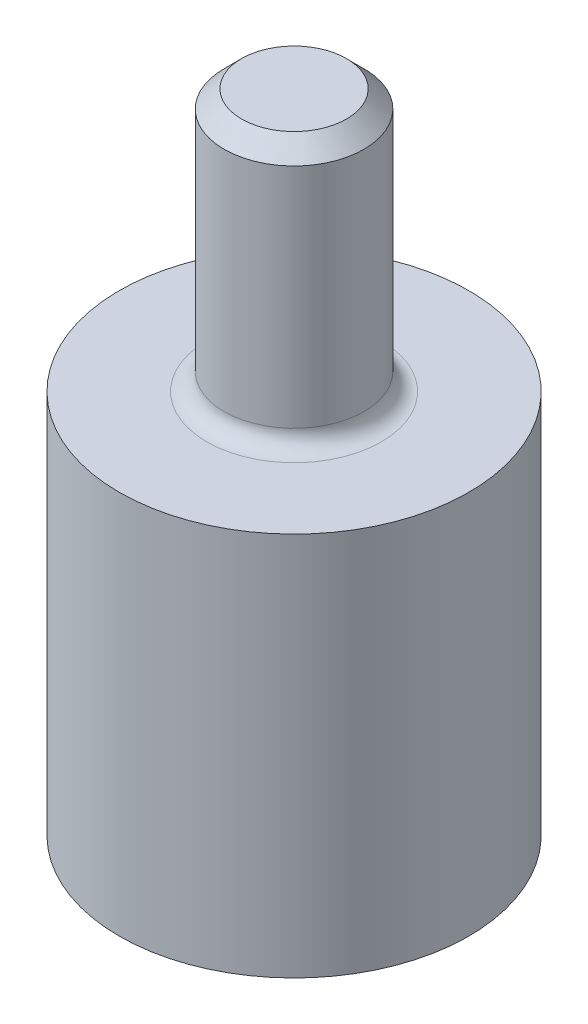
ISO-10303-21;
HEADER;
FILE_DESCRIPTION(('STEP AP214'),'2;1');
FILE_NAME('part.step','',(''),(''),'','','');
FILE_SCHEMA(('AUTOMOTIVE_DESIGN { 1 0 10303 214 1 1 1 1 }'));
ENDSEC;
DATA;
#1=APPLICATION_CONTEXT('core data for automotive mechanical design processes');
#2=APPLICATION_PROTOCOL_DEFINITION('international standard','automotive_design',2000,#1);
#3=PRODUCT_CONTEXT('',#1,'mechanical');
#4=PRODUCT('Part','Part','',(#3));
#5=PRODUCT_RELATED_PRODUCT_CATEGORY('part','',(#4));
#6=PRODUCT_DEFINITION_FORMATION('','',#4);
#7=PRODUCT_DEFINITION_CONTEXT('part definition',#1,'design');
#8=PRODUCT_DEFINITION('design','',#6,#7);
#9=PRODUCT_DEFINITION_SHAPE('','',#8);
#10=(LENGTH_UNIT() NAMED_UNIT(*) SI_UNIT(.MILLI.,.METRE.));
#11=(NAMED_UNIT(*) PLANE_ANGLE_UNIT() SI_UNIT($,.RADIAN.));
#12=(NAMED_UNIT(*) SI_UNIT($,.STERADIAN.) SOLID_ANGLE_UNIT());
#13=UNCERTAINTY_MEASURE_WITH_UNIT(LENGTH_MEASURE(1.E-05),#10,'distance_accuracy_value','');
#14=(GEOMETRIC_REPRESENTATION_CONTEXT(3) GLOBAL_UNCERTAINTY_ASSIGNED_CONTEXT((#13)) GLOBAL_UNIT_ASSIGNED_CONTEXT((#10,
#11,#12)) REPRESENTATION_CONTEXT('',''));
#15=CARTESIAN_POINT('',(0.,0.,0.));
#16=DIRECTION('',(0.,0.,1.));
#17=DIRECTION('',(1.,0.,0.));
#18=AXIS2_PLACEMENT_3D('',#15,#16,#17);
#19=CARTESIAN_POINT('',(0.,22.,0.));
#20=DIRECTION('',(0.,-1.,0.));
#21=DIRECTION('',(0.,0.,-1.));
#22=AXIS2_PLACEMENT_3D('',#19,#20,#21);
#23=CYLINDRICAL_SURFACE('',#22,10.);
#24=CARTESIAN_POINT('',(-10.,2.65,0.));
#25=CARTESIAN_POINT('',(-9.99999888063832,2.65000317277199,-0.0754619928033734));
#26=CARTESIAN_POINT('',(-9.99913682811447,2.65634858042257,-0.150969869142969));
#27=CARTESIAN_POINT('',(-9.99578086597856,2.68155946395463,-0.29988092356667));
#28=CARTESIAN_POINT('',(-9.99328529597587,2.70043767909989,-0.373281880743254));
#29=CARTESIAN_POINT('',(-9.98694317619014,2.7501447786592,-0.515802030248598));
#30=CARTESIAN_POINT('',(-9.98309757849417,2.78096524256388,-0.584924199822183));
#31=CARTESIAN_POINT('',(-9.9744820594727,2.85366269211814,-0.717003214570632));
#32=CARTESIAN_POINT('',(-9.96971228523732,2.89553791869733,-0.779961038453511));
#33=CARTESIAN_POINT('',(-9.95974611568941,2.98944147754408,-0.898338108312009));
#34=CARTESIAN_POINT('',(-9.95454744334816,3.04152632870852,-0.953712333159151));
#35=CARTESIAN_POINT('',(-9.9443275535923,3.15424914589613,-1.05496231993912));
#36=CARTESIAN_POINT('',(-9.93930634565644,3.2148875679238,-1.10083757514474));
#37=CARTESIAN_POINT('',(-9.92998765268688,3.34329274754207,-1.18195809747663));
#38=CARTESIAN_POINT('',(-9.92569310616535,3.41108672869265,-1.21716063931035));
#39=CARTESIAN_POINT('',(-9.91834447659887,3.55169218639022,-1.27566354643984));
#40=CARTESIAN_POINT('',(-9.9152903388053,3.62450344132103,-1.29896443705713));
#41=CARTESIAN_POINT('',(-9.9107903599778,3.77260675419918,-1.33286460358717));
#42=CARTESIAN_POINT('',(-9.90933484179661,3.84788101242966,-1.34354033567971));
#43=CARTESIAN_POINT('',(-9.90816739077428,3.99916564561434,-1.3521238264948));
#44=CARTESIAN_POINT('',(-9.90845537651516,4.07517598602955,-1.35003218142711));
#45=CARTESIAN_POINT('',(-9.91073353943524,4.22523956258491,-1.33320294565254));
#46=CARTESIAN_POINT('',(-9.91271233284641,4.29930248057158,-1.31854992526651));
#47=CARTESIAN_POINT('',(-9.9181313878244,4.44390856940861,-1.27714599976141));
#48=CARTESIAN_POINT('',(-9.92157168347992,4.51445165811811,-1.25039481245862));
#49=CARTESIAN_POINT('',(-9.92953889350849,4.65027630297044,-1.18546414002735));
#50=CARTESIAN_POINT('',(-9.9340692593953,4.71554024852512,-1.14724825716348));
#51=CARTESIAN_POINT('',(-9.94370355539347,4.83876090400285,-1.06049899452053));
#52=CARTESIAN_POINT('',(-9.94880751606598,4.89671722422605,-1.01196506487275));
#53=CARTESIAN_POINT('',(-9.95906440897064,5.00416806207097,-0.905490408568418));
#54=CARTESIAN_POINT('',(-9.96421740371901,5.05359043725637,-0.847476855238479));
#55=CARTESIAN_POINT('',(-9.97395328850661,5.14200755646752,-0.723939528141936));
#56=CARTESIAN_POINT('',(-9.97853617683064,5.18100226912122,-0.65841573178129));
#57=CARTESIAN_POINT('',(-9.98661902116,5.24745857768345,-0.521659654039003));
#58=CARTESIAN_POINT('',(-9.99011851559678,5.2749152597109,-0.450424955814264));
#59=CARTESIAN_POINT('',(-9.99563623203195,5.31745678749493,-0.304298284152512));
#60=CARTESIAN_POINT('',(-9.99765453499948,5.33254230952476,-0.229406510867798));
#61=CARTESIAN_POINT('',(-9.99997186248422,5.349818874499,-0.078714934673022));
#62=CARTESIAN_POINT('',(-10.0002841271737,5.35210922101182,-0.00292671255106484));
#63=CARTESIAN_POINT('',(-9.99919005352924,5.34399305905822,0.147952556499445));
#64=CARTESIAN_POINT('',(-9.99778375804286,5.33358686714471,0.22304362076266));
#65=CARTESIAN_POINT('',(-9.99341879328227,5.30045555402826,0.370101053494709));
#66=CARTESIAN_POINT('',(-9.99046614145111,5.27777817326132,0.442078371506373));
#67=CARTESIAN_POINT('',(-9.98333879043991,5.22079811250311,0.581208755482311));
#68=CARTESIAN_POINT('',(-9.97916404358472,5.18649497897124,0.648361633112986));
#69=CARTESIAN_POINT('',(-9.97002435262575,5.10699965932624,0.776377832753262));
#70=CARTESIAN_POINT('',(-9.9650548411669,5.0617437070004,0.837201225473106));
#71=CARTESIAN_POINT('',(-9.9548947947186,4.96171706429935,0.950424716120299));
#72=CARTESIAN_POINT('',(-9.94970424944,4.90694593062478,1.00282442138043));
#73=CARTESIAN_POINT('',(-9.93964585603091,4.78900444544845,1.09806885763805));
#74=CARTESIAN_POINT('',(-9.93478039313452,4.7257804702606,1.14084747545805));
#75=CARTESIAN_POINT('',(-9.92596344446456,4.59298629332693,1.21517761423776));
#76=CARTESIAN_POINT('',(-9.9220119378588,4.52341623628052,1.24672939110457));
#77=CARTESIAN_POINT('',(-9.91548697301,4.38011191166092,1.29760489107688));
#78=CARTESIAN_POINT('',(-9.91290942391312,4.30639073671037,1.31696494568639));
#79=CARTESIAN_POINT('',(-9.90941281755323,4.15670648021006,1.34302395800419));
#80=CARTESIAN_POINT('',(-9.90849366916185,4.08074352207844,1.34972361139683));
#81=CARTESIAN_POINT('',(-9.90842088198776,3.92939016878468,1.35025744062788));
#82=CARTESIAN_POINT('',(-9.90925298633456,3.85400012601917,1.34419550785697));
#83=CARTESIAN_POINT('',(-9.9125581709462,3.70532136888273,1.31959923933092));
#84=CARTESIAN_POINT('',(-9.91503125042156,3.63203265350087,1.30106490957631));
#85=CARTESIAN_POINT('',(-9.9213351038829,3.48965638877924,1.25208409948606));
#86=CARTESIAN_POINT('',(-9.92516520887735,3.42056678897022,1.22164348798663));
#87=CARTESIAN_POINT('',(-9.93375254177548,3.28845907523205,1.14972442541764));
#88=CARTESIAN_POINT('',(-9.93850978887523,3.22544108705338,1.10824574580314));
#89=CARTESIAN_POINT('',(-9.94846169128068,3.10673549302644,1.01504542221476));
#90=CARTESIAN_POINT('',(-9.95365946544203,3.05110881813496,0.963246499079042));
#91=CARTESIAN_POINT('',(-9.96387978259459,2.94929879836129,0.851038566680569));
#92=CARTESIAN_POINT('',(-9.9689022842334,2.90311766965874,0.790627542416163));
#93=CARTESIAN_POINT('',(-9.97823111031075,2.82133168551852,0.662599690813559));
#94=CARTESIAN_POINT('',(-9.98253416400673,2.7857745822162,0.594952131612163));
#95=CARTESIAN_POINT('',(-9.98990664479829,2.72657756562985,0.454623107862652));
#96=CARTESIAN_POINT('',(-9.99297738800135,2.70292493147276,0.381947111499173));
#97=CARTESIAN_POINT('',(-9.99681378831678,2.67375878792272,0.257427740790176));
#98=CARTESIAN_POINT('',(-9.99800267851091,2.66486234984302,0.206363707072772));
#99=CARTESIAN_POINT('',(-9.99959616481477,2.65298189433552,0.103540312770609));
#100=CARTESIAN_POINT('',(-10.0000007680903,2.64999782288846,0.0517809585431028));
#101=CARTESIAN_POINT('',(-10.,2.65,0.));
#102=B_SPLINE_CURVE_WITH_KNOTS('',3,(#24,#25,#26,#27,#28,#29,#30,#31,#32,#33,#34,#35,#36,#37,
#38,#39,#40,#41,#42,#43,#44,#45,#46,#47,#48,#49,#50,#51,#52,#53,#54,#55,#56,#57,#58,#59,#60,#61,
#62,#63,#64,#65,#66,#67,#68,#69,#70,#71,#72,#73,#74,#75,#76,#77,#78,#79,#80,#81,#82,#83,#84,#85,
#86,#87,#88,#89,#90,#91,#92,#93,#94,#95,#96,#97,#98,#99,#100,#101),.UNSPECIFIED.,.T.,.F.,(4,2,2,
2,2,2,2,2,2,2,2,2,2,2,2,2,2,2,2,2,2,2,2,2,2,2,2,2,2,2,2,2,2,2,2,2,2,2,4),(0.,0.226196811709442,
0.452623899192089,0.67889162204794,0.905123362114559,1.13264478023607,1.3601783324746,
1.58861107839265,1.81703374075091,2.04406590633333,2.27108747007041,2.49659249268716,
2.7221027753678,2.94833671659616,3.17458271729316,3.40265648023177,3.63073092933234,
3.85890241385548,4.08706142448284,4.31344720305693,4.53982733744595,4.76533301790314,
4.9908474967373,5.21770789165439,5.44457885852408,5.67296416747486,5.90134427022682,
6.12904053575398,6.35672428909188,6.58256165180532,6.80839890586773,7.03412498039198,
7.25985572897408,7.48734500396144,7.71488759298809,7.94343804954776,8.17174376045445,
8.326958250701,8.4821713227998),.UNSPECIFIED.);
#103=CARTESIAN_POINT('',(-10.,2.65,0.));
#104=VERTEX_POINT('',#103);
#105=EDGE_CURVE('E65',#104,#104,#102,.T.);
#106=ORIENTED_EDGE('',*,*,#105,.T.);
#107=EDGE_LOOP('',(#106));
#108=FACE_BOUND('',#107,.T.);
#109=CARTESIAN_POINT('',(0.,5.35,-10.));
#110=CARTESIAN_POINT('',(-0.0754619928033734,5.34999682722801,-9.99999888063832));
#111=CARTESIAN_POINT('',(-0.150969869142969,5.34365141957743,-9.99913682811447));
#112=CARTESIAN_POINT('',(-0.29988092356667,5.31844053604537,-9.99578086597856));
#113=CARTESIAN_POINT('',(-0.373281880743254,5.29956232090011,-9.99328529597587));
#114=CARTESIAN_POINT('',(-0.515802030248598,5.2498552213408,-9.98694317619014));
#115=CARTESIAN_POINT('',(-0.584924199822183,5.21903475743613,-9.98309757849417));
#116=CARTESIAN_POINT('',(-0.717003214570632,5.14633730788186,-9.9744820594727));
#117=CARTESIAN_POINT('',(-0.779961038453512,5.10446208130267,-9.96971228523732));
#118=CARTESIAN_POINT('',(-0.898338108312009,5.01055852245592,-9.95974611568941));
#119=CARTESIAN_POINT('',(-0.953712333159151,4.95847367129148,-9.95454744334816));
#120=CARTESIAN_POINT('',(-1.05496231993912,4.84575085410387,-9.9443275535923));
#121=CARTESIAN_POINT('',(-1.10083757514474,4.7851124320762,-9.93930634565644));
#122=CARTESIAN_POINT('',(-1.18195809747663,4.65670725245793,-9.92998765268688));
#123=CARTESIAN_POINT('',(-1.21716063931035,4.58891327130735,-9.92569310616535));
#124=CARTESIAN_POINT('',(-1.27566354643984,4.44830781360978,-9.91834447659887));
#125=CARTESIAN_POINT('',(-1.29896443705713,4.37549655867898,-9.9152903388053));
#126=CARTESIAN_POINT('',(-1.33286460358717,4.22739324580082,-9.9107903599778));
#127=CARTESIAN_POINT('',(-1.34354033567971,4.15211898757034,-9.90933484179661));
#128=CARTESIAN_POINT('',(-1.3521238264948,4.00083435438566,-9.90816739077428));
#129=CARTESIAN_POINT('',(-1.35003218142711,3.92482401397045,-9.90845537651516));
#130=CARTESIAN_POINT('',(-1.33320294565254,3.77476043741509,-9.91073353943524));
#131=CARTESIAN_POINT('',(-1.31854992526651,3.70069751942843,-9.91271233284641));
#132=CARTESIAN_POINT('',(-1.27714599976141,3.55609143059139,-9.9181313878244));
#133=CARTESIAN_POINT('',(-1.25039481245862,3.48554834188189,-9.92157168347992));
#134=CARTESIAN_POINT('',(-1.18546414002735,3.34972369702956,-9.92953889350849));
#135=CARTESIAN_POINT('',(-1.14724825716348,3.28445975147488,-9.9340692593953));
#136=CARTESIAN_POINT('',(-1.06049899452053,3.16123909599715,-9.94370355539348));
#137=CARTESIAN_POINT('',(-1.01196506487275,3.10328277577395,-9.94880751606598));
#138=CARTESIAN_POINT('',(-0.905490408568418,2.99583193792903,-9.95906440897064));
#139=CARTESIAN_POINT('',(-0.84747685523848,2.94640956274364,-9.96421740371901));
#140=CARTESIAN_POINT('',(-0.723939528141936,2.85799244353248,-9.97395328850662));
#141=CARTESIAN_POINT('',(-0.65841573178129,2.81899773087878,-9.97853617683064));
#142=CARTESIAN_POINT('',(-0.521659654039003,2.75254142231655,-9.98661902116));
#143=CARTESIAN_POINT('',(-0.450424955814264,2.7250847402891,-9.99011851559678));
#144=CARTESIAN_POINT('',(-0.304298284152512,2.68254321250507,-9.99563623203195));
#145=CARTESIAN_POINT('',(-0.229406510867799,2.66745769047524,-9.99765453499948));
#146=CARTESIAN_POINT('',(-0.0787149346730221,2.650181125501,-9.99997186248422));
#147=CARTESIAN_POINT('',(-0.00292671255106494,2.64789077898818,-10.0002841271737));
#148=CARTESIAN_POINT('',(0.147952556499445,2.65600694094178,-9.99919005352924));
#149=CARTESIAN_POINT('',(0.22304362076266,2.66641313285529,-9.99778375804286));
#150=CARTESIAN_POINT('',(0.370101053494709,2.69954444597174,-9.99341879328227));
#151=CARTESIAN_POINT('',(0.442078371506373,2.72222182673868,-9.99046614145111));
#152=CARTESIAN_POINT('',(0.581208755482312,2.77920188749689,-9.98333879043991));
#153=CARTESIAN_POINT('',(0.648361633112987,2.81350502102876,-9.97916404358472));
#154=CARTESIAN_POINT('',(0.776377832753262,2.89300034067376,-9.97002435262575));
#155=CARTESIAN_POINT('',(0.837201225473106,2.9382562929996,-9.9650548411669));
#156=CARTESIAN_POINT('',(0.950424716120298,3.03828293570065,-9.9548947947186));
#157=CARTESIAN_POINT('',(1.00282442138043,3.09305406937521,-9.94970424944));
#158=CARTESIAN_POINT('',(1.09806885763805,3.21099555455155,-9.93964585603091));
#159=CARTESIAN_POINT('',(1.14084747545805,3.2742195297394,-9.93478039313452));
#160=CARTESIAN_POINT('',(1.21517761423776,3.40701370667307,-9.92596344446456));
#161=CARTESIAN_POINT('',(1.24672939110457,3.47658376371948,-9.9220119378588));
#162=CARTESIAN_POINT('',(1.29760489107688,3.61988808833909,-9.91548697301));
#163=CARTESIAN_POINT('',(1.31696494568639,3.69360926328963,-9.91290942391312));
#164=CARTESIAN_POINT('',(1.34302395800419,3.84329351978994,-9.90941281755323));
#165=CARTESIAN_POINT('',(1.34972361139683,3.91925647792156,-9.90849366916185));
#166=CARTESIAN_POINT('',(1.35025744062788,4.07060983121533,-9.90842088198776));
#167=CARTESIAN_POINT('',(1.34419550785697,4.14599987398084,-9.90925298633456));
#168=CARTESIAN_POINT('',(1.31959923933092,4.29467863111727,-9.9125581709462));
#169=CARTESIAN_POINT('',(1.30106490957631,4.36796734649913,-9.91503125042156));
#170=CARTESIAN_POINT('',(1.25208409948606,4.51034361122076,-9.9213351038829));
#171=CARTESIAN_POINT('',(1.22164348798663,4.57943321102978,-9.92516520887735));
#172=CARTESIAN_POINT('',(1.14972442541764,4.71154092476795,-9.93375254177548));
#173=CARTESIAN_POINT('',(1.10824574580314,4.77455891294662,-9.93850978887523));
#174=CARTESIAN_POINT('',(1.01504542221476,4.89326450697356,-9.94846169128068));
#175=CARTESIAN_POINT('',(0.963246499079042,4.94889118186504,-9.95365946544203));
#176=CARTESIAN_POINT('',(0.851038566680568,5.05070120163871,-9.96387978259459));
#177=CARTESIAN_POINT('',(0.790627542416163,5.09688233034126,-9.9689022842334));
#178=CARTESIAN_POINT('',(0.662599690813559,5.17866831448148,-9.97823111031075));
#179=CARTESIAN_POINT('',(0.594952131612162,5.2142254177838,-9.98253416400673));
#180=CARTESIAN_POINT('',(0.454623107862652,5.27342243437015,-9.98990664479829));
#181=CARTESIAN_POINT('',(0.381947111499173,5.29707506852724,-9.99297738800135));
#182=CARTESIAN_POINT('',(0.257427740790176,5.32624121207728,-9.99681378831678));
#183=CARTESIAN_POINT('',(0.206363707072772,5.33513765015697,-9.99800267851091));
#184=CARTESIAN_POINT('',(0.103540312770609,5.34701810566448,-9.99959616481477));
#185=CARTESIAN_POINT('',(0.0517809585431027,5.35000217711154,-10.0000007680903));
#186=CARTESIAN_POINT('',(0.,5.35,-10.));
#187=B_SPLINE_CURVE_WITH_KNOTS('',3,(#109,#110,#111,#112,#113,#114,#115,#116,#117,#118,#119,
#120,#121,#122,#123,#124,#125,#126,#127,#128,#129,#130,#131,#132,#133,#134,#135,#136,#137,#138,
#139,#140,#141,#142,#143,#144,#145,#146,#147,#148,#149,#150,#151,#152,#153,#154,#155,#156,#157,
#158,#159,#160,#161,#162,#163,#164,#165,#166,#167,#168,#169,#170,#171,#172,#173,#174,#175,#176,
#177,#178,#179,#180,#181,#182,#183,#184,#185,#186),.UNSPECIFIED.,.T.,.F.,(4,2,2,2,2,2,2,2,2,2,2,
2,2,2,2,2,2,2,2,2,2,2,2,2,2,2,2,2,2,2,2,2,2,2,2,2,2,2,4),(0.,0.226196811709442,
0.452623899192089,0.67889162204794,0.90512336211456,1.13264478023607,1.3601783324746,
1.58861107839265,1.81703374075091,2.04406590633333,2.27108747007041,2.49659249268716,
2.7221027753678,2.94833671659616,3.17458271729316,3.40265648023177,3.63073092933234,
3.85890241385548,4.08706142448284,4.31344720305693,4.53982733744595,4.76533301790314,
4.9908474967373,5.21770789165439,5.44457885852408,5.67296416747486,5.90134427022682,
6.12904053575398,6.35672428909188,6.58256165180532,6.80839890586773,7.03412498039198,
7.25985572897408,7.48734500396144,7.71488759298809,7.94343804954776,8.17174376045445,
8.326958250701,8.4821713227998),.UNSPECIFIED.);
#188=CARTESIAN_POINT('',(0.,5.35,-10.));
#189=VERTEX_POINT('',#188);
#190=EDGE_CURVE('E64',#189,#189,#187,.T.);
#191=ORIENTED_EDGE('',*,*,#190,.T.);
#192=EDGE_LOOP('',(#191));
#193=FACE_BOUND('',#192,.T.);
#194=CARTESIAN_POINT('',(0.,22.,0.));
#195=DIRECTION('',(0.,1.,0.));
#196=DIRECTION('',(0.,0.,1.));
#197=AXIS2_PLACEMENT_3D('',#194,#195,#196);
#198=CIRCLE('',#197,10.);
#199=CARTESIAN_POINT('',(0.,22.,10.));
#200=VERTEX_POINT('',#199);
#201=EDGE_CURVE('E118',#200,#200,#198,.T.);
#202=ORIENTED_EDGE('',*,*,#201,.F.);
#203=EDGE_LOOP('',(#202));
#204=FACE_BOUND('',#203,.T.);
#205=CARTESIAN_POINT('',(0.,0.,0.));
#206=DIRECTION('',(0.,1.,0.));
#207=DIRECTION('',(0.,0.,1.));
#208=AXIS2_PLACEMENT_3D('',#205,#206,#207);
#209=CIRCLE('',#208,10.);
#210=CARTESIAN_POINT('',(0.,0.,10.));
#211=VERTEX_POINT('',#210);
#212=EDGE_CURVE('E121',#211,#211,#209,.T.);
#213=ORIENTED_EDGE('',*,*,#212,.T.);
#214=EDGE_LOOP('',(#213));
#215=FACE_BOUND('',#214,.T.);
#216=ADVANCED_FACE('F37',(#108,#193,#204,#215),#23,.T.);
#217=CARTESIAN_POINT('',(0.,22.,0.));
#218=DIRECTION('',(0.,1.,0.));
#219=DIRECTION('',(0.,0.,1.));
#220=AXIS2_PLACEMENT_3D('',#217,#218,#219);
#221=PLANE('',#220);
#222=CARTESIAN_POINT('',(0.,22.,0.));
#223=DIRECTION('',(0.,1.,0.));
#224=DIRECTION('',(0.,0.,1.));
#225=AXIS2_PLACEMENT_3D('',#222,#223,#224);
#226=CIRCLE('',#225,5.);
#227=CARTESIAN_POINT('',(0.,22.,5.));
#228=VERTEX_POINT('',#227);
#229=EDGE_CURVE('E55',#228,#228,#226,.F.);
#230=ORIENTED_EDGE('',*,*,#229,.T.);
#231=EDGE_LOOP('',(#230));
#232=FACE_BOUND('',#231,.T.);
#233=ORIENTED_EDGE('',*,*,#201,.T.);
#234=EDGE_LOOP('',(#233));
#235=FACE_BOUND('',#234,.T.);
#236=ADVANCED_FACE('F95',(#232,#235),#221,.T.);
#237=CARTESIAN_POINT('',(0.,0.,0.));
#238=DIRECTION('',(0.,1.,0.));
#239=DIRECTION('',(0.,0.,1.));
#240=AXIS2_PLACEMENT_3D('',#237,#238,#239);
#241=PLANE('',#240);
#242=CARTESIAN_POINT('',(0.,0.,0.));
#243=DIRECTION('',(0.,-1.,0.));
#244=DIRECTION('',(0.,0.,-1.));
#245=AXIS2_PLACEMENT_3D('',#242,#243,#244);
#246=CIRCLE('',#245,3.);
#247=CARTESIAN_POINT('',(0.,0.,-3.));
#248=VERTEX_POINT('',#247);
#249=EDGE_CURVE('E86',#248,#248,#246,.T.);
#250=ORIENTED_EDGE('',*,*,#249,.F.);
#251=EDGE_LOOP('',(#250));
#252=FACE_BOUND('',#251,.T.);
#253=ORIENTED_EDGE('',*,*,#212,.F.);
#254=EDGE_LOOP('',(#253));
#255=FACE_BOUND('',#254,.T.);
#256=ADVANCED_FACE('F97',(#252,#255),#241,.F.);
#257=CARTESIAN_POINT('',(0.,37.,0.));
#258=DIRECTION('',(0.,-1.,0.));
#259=DIRECTION('',(0.,0.,-1.));
#260=AXIS2_PLACEMENT_3D('',#257,#258,#259);
#261=CYLINDRICAL_SURFACE('',#260,4.);
#262=CARTESIAN_POINT('',(0.,36.,0.));
#263=DIRECTION('',(0.,1.,0.));
#264=DIRECTION('',(0.,0.,1.));
#265=AXIS2_PLACEMENT_3D('',#262,#263,#264);
#266=CIRCLE('',#265,4.);
#267=CARTESIAN_POINT('',(0.,36.,4.));
#268=VERTEX_POINT('',#267);
#269=EDGE_CURVE('E10',#268,#268,#266,.F.);
#270=ORIENTED_EDGE('',*,*,#269,.T.);
#271=EDGE_LOOP('',(#270));
#272=FACE_BOUND('',#271,.T.);
#273=CARTESIAN_POINT('',(0.,23.,0.));
#274=DIRECTION('',(0.,1.,0.));
#275=DIRECTION('',(0.,0.,1.));
#276=AXIS2_PLACEMENT_3D('',#273,#274,#275);
#277=CIRCLE('',#276,4.);
#278=CARTESIAN_POINT('',(0.,23.,4.));
#279=VERTEX_POINT('',#278);
#280=EDGE_CURVE('E116',#279,#279,#277,.T.);
#281=ORIENTED_EDGE('',*,*,#280,.T.);
#282=EDGE_LOOP('',(#281));
#283=FACE_BOUND('',#282,.T.);
#284=ADVANCED_FACE('F109',(#272,#283),#261,.T.);
#285=CARTESIAN_POINT('',(0.,37.,0.));
#286=DIRECTION('',(0.,1.,0.));
#287=DIRECTION('',(0.,0.,1.));
#288=AXIS2_PLACEMENT_3D('',#285,#286,#287);
#289=PLANE('',#288);
#290=CARTESIAN_POINT('',(0.,37.,0.));
#291=DIRECTION('',(0.,1.,0.));
#292=DIRECTION('',(0.,0.,1.));
#293=AXIS2_PLACEMENT_3D('',#290,#291,#292);
#294=CIRCLE('',#293,3.);
#295=CARTESIAN_POINT('',(0.,37.,3.));
#296=VERTEX_POINT('',#295);
#297=EDGE_CURVE('E50',#296,#296,#294,.T.);
#298=ORIENTED_EDGE('',*,*,#297,.T.);
#299=EDGE_LOOP('',(#298));
#300=FACE_BOUND('',#299,.T.);
#301=ADVANCED_FACE('F102',(#300),#289,.T.);
#302=CARTESIAN_POINT('',(0.,23.,0.));
#303=DIRECTION('',(0.,1.,0.));
#304=DIRECTION('',(0.,0.,1.));
#305=AXIS2_PLACEMENT_3D('',#302,#303,#304);
#306=TOROIDAL_SURFACE('',#305,5.,1.);
#307=ORIENTED_EDGE('',*,*,#229,.F.);
#308=EDGE_LOOP('',(#307));
#309=FACE_BOUND('',#308,.T.);
#310=ORIENTED_EDGE('',*,*,#280,.F.);
#311=EDGE_LOOP('',(#310));
#312=FACE_BOUND('',#311,.T.);
#313=ADVANCED_FACE('F99',(#309,#312),#306,.F.);
#314=CARTESIAN_POINT('',(0.,37.,0.));
#315=DIRECTION('',(0.,-1.,0.));
#316=DIRECTION('',(0.,0.,-1.));
#317=AXIS2_PLACEMENT_3D('',#314,#315,#316);
#318=CONICAL_SURFACE('',#317,3.,0.785398163397443);
#319=ORIENTED_EDGE('',*,*,#269,.F.);
#320=EDGE_LOOP('',(#319));
#321=FACE_BOUND('',#320,.T.);
#322=ORIENTED_EDGE('',*,*,#297,.F.);
#323=EDGE_LOOP('',(#322));
#324=FACE_BOUND('',#323,.T.);
#325=ADVANCED_FACE('F39',(#321,#324),#318,.T.);
#326=CARTESIAN_POINT('',(0.,16.,0.));
#327=DIRECTION('',(0.,-1.,0.));
#328=DIRECTION('',(0.,0.,-1.));
#329=AXIS2_PLACEMENT_3D('',#326,#327,#328);
#330=CYLINDRICAL_SURFACE('',#329,3.);
#331=CARTESIAN_POINT('',(-2.67908566492376,4.,-1.35));
#332=CARTESIAN_POINT('',(-2.67908972136357,3.92862205356704,-1.34999634960118));
#333=CARTESIAN_POINT('',(-2.68197986470892,3.8571308049357,-1.34430280693502));
#334=CARTESIAN_POINT('',(-2.69314748719365,3.71626142482299,-1.3217815708751));
#335=CARTESIAN_POINT('',(-2.70143841174077,3.64688902071627,-1.30492608775202));
#336=CARTESIAN_POINT('',(-2.72226347568043,3.51255032987877,-1.26089890657752));
#337=CARTESIAN_POINT('',(-2.73477832820249,3.44756559894425,-1.23377403224336));
#338=CARTESIAN_POINT('',(-2.76261183069861,3.32308557043469,-1.1701189461529));
#339=CARTESIAN_POINT('',(-2.77793013877675,3.26358960480564,-1.13358988106566));
#340=CARTESIAN_POINT('',(-2.81089012139633,3.14740913171342,-1.04932009765931));
#341=CARTESIAN_POINT('',(-2.82861845893337,3.0911710360769,-1.00099751939836));
#342=CARTESIAN_POINT('',(-2.86369435251158,2.98726055603832,-0.8957298874375));
#343=CARTESIAN_POINT('',(-2.8810417440569,2.93959181050447,-0.838781189587369));
#344=CARTESIAN_POINT('',(-2.91448488106424,2.85175851979836,-0.714242041658825));
#345=CARTESIAN_POINT('',(-2.9304683741236,2.81211414726832,-0.646251809658565));
#346=CARTESIAN_POINT('',(-2.95829847107112,2.74502381155761,-0.503715605802075));
#347=CARTESIAN_POINT('',(-2.97014720161912,2.71757157552721,-0.429173028829625));
#348=CARTESIAN_POINT('',(-2.98775470090972,2.67731876304834,-0.280352179284939));
#349=CARTESIAN_POINT('',(-2.99383392314784,2.66374348328954,-0.206322168674059));
#350=CARTESIAN_POINT('',(-3.00039373369951,2.6491083632026,-0.0568029105740024));
#351=CARTESIAN_POINT('',(-3.00087699987058,2.64804253666733,0.0186856216373247));
#352=CARTESIAN_POINT('',(-2.99636545093253,2.65809076897363,0.163274958357676));
#353=CARTESIAN_POINT('',(-2.9917559075982,2.66834817683915,0.232449739495251));
#354=CARTESIAN_POINT('',(-2.97812620546336,2.69925891111155,0.367973075543692));
#355=CARTESIAN_POINT('',(-2.96910571978628,2.7199130079771,0.434321420602955));
#356=CARTESIAN_POINT('',(-2.94733568420856,2.77124683034536,0.563537397240552));
#357=CARTESIAN_POINT('',(-2.93453157396088,2.80207407192074,0.626336852256068));
#358=CARTESIAN_POINT('',(-2.90640952714529,2.87271777707694,0.746035931554187));
#359=CARTESIAN_POINT('',(-2.89109067198747,2.91253752745949,0.802933387505527));
#360=CARTESIAN_POINT('',(-2.85798888844785,3.00373350143222,0.914071051759804));
#361=CARTESIAN_POINT('',(-2.84010687280163,3.05578049401002,0.967732040593638));
#362=CARTESIAN_POINT('',(-2.80476557445095,3.16810438031976,1.06583995565248));
#363=CARTESIAN_POINT('',(-2.78730651669438,3.2283855449261,1.1102820699331));
#364=CARTESIAN_POINT('',(-2.75401135094477,3.358741405317,1.1905438861065));
#365=CARTESIAN_POINT('',(-2.7382791614958,3.42912846220238,1.2259032914578));
#366=CARTESIAN_POINT('',(-2.71151624518558,3.5757484282565,1.28402300568714));
#367=CARTESIAN_POINT('',(-2.70048151987999,3.65197630028142,1.30679403464254));
#368=CARTESIAN_POINT('',(-2.68540623610429,3.80229624329304,1.33748549179434));
#369=CARTESIAN_POINT('',(-2.68092046697284,3.87614882837877,1.34635462348056));
#370=CARTESIAN_POINT('',(-2.67817358123966,4.0244075860419,1.3518134548202));
#371=CARTESIAN_POINT('',(-2.6799096349927,4.09881349161162,1.34840873653788));
#372=CARTESIAN_POINT('',(-2.68894505411098,4.23976009892583,1.33028529698142));
#373=CARTESIAN_POINT('',(-2.69578776258231,4.30645348586734,1.31649446313373));
#374=CARTESIAN_POINT('',(-2.71364654941982,4.43649979275729,1.27927525451619));
#375=CARTESIAN_POINT('',(-2.72466371916185,4.4998518342021,1.25584435930022));
#376=CARTESIAN_POINT('',(-2.75022888790586,4.62462890246769,1.19885570750059));
#377=CARTESIAN_POINT('',(-2.76491376583275,4.68583801896824,1.1648887379257));
#378=CARTESIAN_POINT('',(-2.79599373408588,4.80201016829177,1.0881775673345));
#379=CARTESIAN_POINT('',(-2.81238963825979,4.85697020253697,1.04542917999879));
#380=CARTESIAN_POINT('',(-2.84697800672908,4.96469532276455,0.947453264529428));
#381=CARTESIAN_POINT('',(-2.86518924991743,5.01671913710597,0.891413865022647));
#382=CARTESIAN_POINT('',(-2.89990574886455,5.11079592633481,0.771017984619228));
#383=CARTESIAN_POINT('',(-2.91641073613078,5.15284733332998,0.706660198334776));
#384=CARTESIAN_POINT('',(-2.9461052573818,5.22603768494213,0.570409325455863));
#385=CARTESIAN_POINT('',(-2.95926013204552,5.25706376959214,0.498447571519417));
#386=CARTESIAN_POINT('',(-2.98050950144873,5.30630574915996,0.349571723618869));
#387=CARTESIAN_POINT('',(-2.98860756344568,5.32453067561052,0.272661163064107));
#388=CARTESIAN_POINT('',(-2.99835968098045,5.34638262551662,0.122636888326816));
#389=CARTESIAN_POINT('',(-3.00047260862348,5.35104990302503,0.049703765394695));
#390=CARTESIAN_POINT('',(-2.99934947885664,5.34855471262021,-0.0959089680211817));
#391=CARTESIAN_POINT('',(-2.99611466133645,5.34139498683108,-0.168588633354792));
#392=CARTESIAN_POINT('',(-2.98491784207744,5.31618858632682,-0.308129692375973));
#393=CARTESIAN_POINT('',(-2.97718164482459,5.29866132882086,-0.37510466911307));
#394=CARTESIAN_POINT('',(-2.95790278165172,5.25383297064309,-0.505107153197962));
#395=CARTESIAN_POINT('',(-2.94635946005498,5.22653018632537,-0.568133978354384));
#396=CARTESIAN_POINT('',(-2.91989573220559,5.16155516971282,-0.691651014019821));
#397=CARTESIAN_POINT('',(-2.90484486776423,5.12346528321307,-0.751892834813511));
#398=CARTESIAN_POINT('',(-2.87307697231938,5.03856635126286,-0.865394775785759));
#399=CARTESIAN_POINT('',(-2.85635922443298,4.99175354672865,-0.918651869019341));
#400=CARTESIAN_POINT('',(-2.82141054489056,4.886299795117,-1.02118014748473));
#401=CARTESIAN_POINT('',(-2.80316664115845,4.82700822517816,-1.06977999794906));
#402=CARTESIAN_POINT('',(-2.76852013319426,4.70063489450023,-1.15649637692139));
#403=CARTESIAN_POINT('',(-2.75211871666422,4.63354816488786,-1.19460616603026));
#404=CARTESIAN_POINT('',(-2.7231408374882,4.49271436555668,-1.25927503316014));
#405=CARTESIAN_POINT('',(-2.71058811915896,4.41892945194263,-1.28576282547059));
#406=CARTESIAN_POINT('',(-2.69134731904104,4.26729704740911,-1.32557656565209));
#407=CARTESIAN_POINT('',(-2.68463956270378,4.18946412738561,-1.33894668780695));
#408=CARTESIAN_POINT('',(-2.68062086017263,4.09260261525468,-1.34694881770107));
#409=CARTESIAN_POINT('',(-2.68004645979514,4.07410767751956,-1.34809182836545));
#410=CARTESIAN_POINT('',(-2.67927832920893,4.03707770948483,-1.34961790578098));
#411=CARTESIAN_POINT('',(-2.67908461113529,4.018542677926,-1.35000094830649));
#412=CARTESIAN_POINT('',(-2.67908566492376,4.,-1.35));
#413=B_SPLINE_CURVE_WITH_KNOTS('',3,(#331,#332,#333,#334,#335,#336,#337,#338,#339,#340,#341,
#342,#343,#344,#345,#346,#347,#348,#349,#350,#351,#352,#353,#354,#355,#356,#357,#358,#359,#360,
#361,#362,#363,#364,#365,#366,#367,#368,#369,#370,#371,#372,#373,#374,#375,#376,#377,#378,#379,
#380,#381,#382,#383,#384,#385,#386,#387,#388,#389,#390,#391,#392,#393,#394,#395,#396,#397,#398,
#399,#400,#401,#402,#403,#404,#405,#406,#407,#408,#409,#410,#411,#412),.UNSPECIFIED.,.T.,.F.,(4,
2,2,2,2,2,2,2,2,2,2,2,2,2,2,2,2,2,2,2,2,2,2,2,2,2,2,2,2,2,2,2,2,2,2,2,2,2,2,2,4),(0.,
0.214055845792532,0.428646637243887,0.642270551908941,0.8558684313711,1.08359761166759,
1.31142326708013,1.55111519146942,1.79068365118271,2.01599531824478,2.24119916146311,
2.45046498111008,2.65974631092609,2.87220645533555,3.08474438091332,3.31433040008769,
3.54403595561181,3.78375440668509,4.02326840132222,4.24558900401108,4.46780850954653,
4.67223214739968,4.87670926691682,5.09041213785303,5.30421712366117,5.53894745661197,
5.77371467014984,6.01082017062588,6.24775821883919,6.4659627629896,6.68411672290069,
6.89217009324631,7.10025931402203,7.31787915069571,7.53559298700253,7.77092535260829,
8.00640855780262,8.24331661272665,8.47942410351746,8.53503010348214,8.5906378759814),.UNSPECIFIED.);
#414=CARTESIAN_POINT('',(-2.67908566492376,4.,-1.35));
#415=VERTEX_POINT('',#414);
#416=EDGE_CURVE('E41',#415,#415,#413,.T.);
#417=ORIENTED_EDGE('',*,*,#416,.T.);
#418=EDGE_LOOP('',(#417));
#419=FACE_BOUND('',#418,.T.);
#420=CARTESIAN_POINT('',(0.,5.35,-3.));
#421=CARTESIAN_POINT('',(0.0717942983232349,5.34999649049952,-2.99999710819746));
#422=CARTESIAN_POINT('',(0.143698325746441,5.3442391326136,-2.99739409084056));
#423=CARTESIAN_POINT('',(0.285432490024626,5.32144029825071,-2.98724013750941));
#424=CARTESIAN_POINT('',(0.355257330555084,5.30437221648136,-2.97967753594657));
#425=CARTESIAN_POINT('',(0.490559033821623,5.25972504248383,-2.96040619544781));
#426=CARTESIAN_POINT('',(0.556050573075538,5.23218381406627,-2.94871240278778));
#427=CARTESIAN_POINT('',(0.681409511271081,5.16754378249057,-2.92229198635354));
#428=CARTESIAN_POINT('',(0.741278103679962,5.13044701377474,-2.90756600828684));
#429=CARTESIAN_POINT('',(0.85718500175379,5.04554215014239,-2.87559272931306));
#430=CARTESIAN_POINT('',(0.91286450103141,4.99727891532799,-2.85825436147132));
#431=CARTESIAN_POINT('',(1.01565685650759,4.89237856122431,-2.8233655994703));
#432=CARTESIAN_POINT('',(1.06276447748726,4.83573636256342,-2.80581508267312));
#433=CARTESIAN_POINT('',(1.14986510805754,4.71161272324326,-2.77130585686826));
#434=CARTESIAN_POINT('',(1.18926734777791,4.64368665704964,-2.75444463646883));
#435=CARTESIAN_POINT('',(1.25592795928377,4.50131112503159,-2.72469944797672));
#436=CARTESIAN_POINT('',(1.28319358757603,4.42686558916672,-2.71181310471532));
#437=CARTESIAN_POINT('',(1.32326532420642,4.2776840691172,-2.69247896324617));
#438=CARTESIAN_POINT('',(1.33676641560757,4.20317630515297,-2.68572383239535));
#439=CARTESIAN_POINT('',(1.35108445296974,4.05267075966227,-2.67855223230496));
#440=CARTESIAN_POINT('',(1.35191020272176,3.9766740490368,-2.67813136354141));
#441=CARTESIAN_POINT('',(1.34137148509328,3.83285083491433,-2.6834202803121));
#442=CARTESIAN_POINT('',(1.33112445451752,3.76491732596293,-2.68856813661517));
#443=CARTESIAN_POINT('',(1.30062891567465,3.63186281413367,-2.7034513561071));
#444=CARTESIAN_POINT('',(1.28037808448852,3.56674246830349,-2.71318778475507));
#445=CARTESIAN_POINT('',(1.23004883795921,3.43939680076966,-2.73637704262371));
#446=CARTESIAN_POINT('',(1.19975839775641,3.37727034100209,-2.74990898685239));
#447=CARTESIAN_POINT('',(1.13036295003033,3.25871554314349,-2.7791537278156));
#448=CARTESIAN_POINT('',(1.09125419168812,3.20228964458414,-2.79486745146097));
#449=CARTESIAN_POINT('',(1.00074678884709,3.09078959543536,-2.82861476581816));
#450=CARTESIAN_POINT('',(0.948509645932172,3.03641657116242,-2.84672309557187));
#451=CARTESIAN_POINT('',(0.835512963309819,2.93694499770968,-2.88191228554332));
#452=CARTESIAN_POINT('',(0.774750728395021,2.89184939274885,-2.89899281837343));
#453=CARTESIAN_POINT('',(0.643994003611891,2.81094173478811,-2.9308585664278));
#454=CARTESIAN_POINT('',(0.573771818637795,2.77546056065231,-2.94555628131278));
#455=CARTESIAN_POINT('',(0.427523890626999,2.71706921712705,-2.9703043427381));
#456=CARTESIAN_POINT('',(0.351501935367017,2.69415092175776,-2.98035769270489));
#457=CARTESIAN_POINT('',(0.201630556677329,2.66310879602898,-2.99409415860333));
#458=CARTESIAN_POINT('',(0.128012475240641,2.65404693380637,-2.99818023391338));
#459=CARTESIAN_POINT('',(-0.019801712975768,2.64812237573977,-3.00084388971438));
#460=CARTESIAN_POINT('',(-0.0939976076148996,2.65125539554464,-2.99942340479119));
#461=CARTESIAN_POINT('',(-0.236163838261613,2.66900351696522,-2.99148733912252));
#462=CARTESIAN_POINT('',(-0.304240885876221,2.68291967296974,-2.98528201918371));
#463=CARTESIAN_POINT('',(-0.436995702745772,2.7208198778082,-2.96875596530774));
#464=CARTESIAN_POINT('',(-0.501673061518972,2.74480513926819,-2.95843473569757));
#465=CARTESIAN_POINT('',(-0.628081970668978,2.80291872769613,-2.93424357362228));
#466=CARTESIAN_POINT('',(-0.689659229503892,2.83733945454487,-2.92027320912254));
#467=CARTESIAN_POINT('',(-0.80638532774347,2.91502830532807,-2.89022166549104));
#468=CARTESIAN_POINT('',(-0.861531338624961,2.95830029926389,-2.87413956415871));
#469=CARTESIAN_POINT('',(-0.96862398801543,3.0566142000046,-2.83992652839844));
#470=CARTESIAN_POINT('',(-1.01993241361648,3.11233220022649,-2.82173597139227));
#471=CARTESIAN_POINT('',(-1.11269266003748,3.23179633834081,-2.78646430195239));
#472=CARTESIAN_POINT('',(-1.15414070031002,3.29554554117557,-2.76938361687061));
#473=CARTESIAN_POINT('',(-1.22692126341054,3.4314471963303,-2.7379338081281));
#474=CARTESIAN_POINT('',(-1.25796777069468,3.50377294902009,-2.72364526364247));
#475=CARTESIAN_POINT('',(-1.30713985771408,3.65347982783719,-2.70039592602715));
#476=CARTESIAN_POINT('',(-1.32527849464679,3.73085575858932,-2.69142975048318));
#477=CARTESIAN_POINT('',(-1.34672717395899,3.8812884472678,-2.68075667169167));
#478=CARTESIAN_POINT('',(-1.35118055215424,3.95414266622579,-2.67849069599059));
#479=CARTESIAN_POINT('',(-1.34828559635269,4.09954638919463,-2.67994960996189));
#480=CARTESIAN_POINT('',(-1.34093995541462,4.17209595895075,-2.68367313256576));
#481=CARTESIAN_POINT('',(-1.31566407238933,4.31006069329408,-2.6961462980684));
#482=CARTESIAN_POINT('',(-1.29843197077116,4.37563699780203,-2.70456348750257));
#483=CARTESIAN_POINT('',(-1.25462062200674,4.50295418142846,-2.7251623303891));
#484=CARTESIAN_POINT('',(-1.22803865491526,4.56469393831044,-2.73734507914543));
#485=CARTESIAN_POINT('',(-1.16431737308181,4.68696554916317,-2.7650759189415));
#486=CARTESIAN_POINT('',(-1.12660616827383,4.74716066900083,-2.78079077572678));
#487=CARTESIAN_POINT('',(-1.04242837649562,4.86072276801658,-2.81342848547022));
#488=CARTESIAN_POINT('',(-0.995958018053227,4.91408678921325,-2.83035185682753));
#489=CARTESIAN_POINT('',(-0.890607785832821,5.01746957365745,-2.86533877617131));
#490=CARTESIAN_POINT('',(-0.830985057931682,5.06674723370793,-2.88336671225994));
#491=CARTESIAN_POINT('',(-0.703694018650896,5.15468476591909,-2.91704362931292));
#492=CARTESIAN_POINT('',(-0.636022027250616,5.19333975458804,-2.93269151464089));
#493=CARTESIAN_POINT('',(-0.495042929060336,5.25833164258285,-2.95973519982059));
#494=CARTESIAN_POINT('',(-0.42179876142431,5.28478756117011,-2.97117185469687));
#495=CARTESIAN_POINT('',(-0.271369105378997,5.32471784820524,-2.98865352259014));
#496=CARTESIAN_POINT('',(-0.194196326987204,5.33823158658109,-2.99471488298502));
#497=CARTESIAN_POINT('',(-0.0971012527230264,5.34664471472681,-2.99849167271413));
#498=CARTESIAN_POINT('',(-0.0777090119997834,5.34790172857583,-2.99905628756061));
#499=CARTESIAN_POINT('',(-0.0388805308187736,5.3495798521772,-2.99981084536562));
#500=CARTESIAN_POINT('',(-0.0194442897624908,5.35000095048975,-3.00000078319655));
#501=CARTESIAN_POINT('',(0.,5.35,-3.));
#502=B_SPLINE_CURVE_WITH_KNOTS('',3,(#420,#421,#422,#423,#424,#425,#426,#427,#428,#429,#430,
#431,#432,#433,#434,#435,#436,#437,#438,#439,#440,#441,#442,#443,#444,#445,#446,#447,#448,#449,
#450,#451,#452,#453,#454,#455,#456,#457,#458,#459,#460,#461,#462,#463,#464,#465,#466,#467,#468,
#469,#470,#471,#472,#473,#474,#475,#476,#477,#478,#479,#480,#481,#482,#483,#484,#485,#486,#487,
#488,#489,#490,#491,#492,#493,#494,#495,#496,#497,#498,#499,#500,#501),.UNSPECIFIED.,.T.,.F.,(4,
2,2,2,2,2,2,2,2,2,2,2,2,2,2,2,2,2,2,2,2,2,2,2,2,2,2,2,2,2,2,2,2,2,2,2,2,2,2,2,4),(0.,
0.215303084427218,0.43111441493177,0.6461528234083,0.861145486470537,1.08726953424049,
1.31353122563332,1.55326754039453,1.79286032311304,2.01964651955437,2.24627519213992,
2.45199894249931,2.65777048513474,2.86819857827374,3.07871634515167,3.31031406768874,
3.54198517551711,3.78083332859654,4.01952680594871,4.24120773308938,4.46281078549605,
4.67114116806696,4.87949664714236,5.094335578217,5.30926864394809,5.54191493070126,
5.77465027258591,6.01334164055914,6.25179121126566,6.46968869048819,6.68753644292215,
6.89161899090661,7.09576095718725,7.31311389683911,7.53056063789666,7.76770791551891,
8.00496403362732,8.23985367573745,8.47402649574549,8.53233695168291,8.59064820561442),.UNSPECIFIED.);
#503=CARTESIAN_POINT('',(0.,5.35,-3.));
#504=VERTEX_POINT('',#503);
#505=EDGE_CURVE('E58',#504,#504,#502,.T.);
#506=ORIENTED_EDGE('',*,*,#505,.T.);
#507=EDGE_LOOP('',(#506));
#508=FACE_BOUND('',#507,.T.);
#509=CARTESIAN_POINT('',(0.,16.,0.));
#510=DIRECTION('',(0.,-1.,0.));
#511=DIRECTION('',(0.,0.,-1.));
#512=AXIS2_PLACEMENT_3D('',#509,#510,#511);
#513=CIRCLE('',#512,3.);
#514=CARTESIAN_POINT('',(0.,16.,-3.));
#515=VERTEX_POINT('',#514);
#516=EDGE_CURVE('E90',#515,#515,#513,.T.);
#517=ORIENTED_EDGE('',*,*,#516,.F.);
#518=EDGE_LOOP('',(#517));
#519=FACE_BOUND('',#518,.T.);
#520=ORIENTED_EDGE('',*,*,#249,.T.);
#521=EDGE_LOOP('',(#520));
#522=FACE_BOUND('',#521,.T.);
#523=ADVANCED_FACE('F66',(#419,#508,#519,#522),#330,.F.);
#524=CARTESIAN_POINT('',(0.,16.,0.));
#525=DIRECTION('',(0.,-1.,0.));
#526=DIRECTION('',(0.,0.,-1.));
#527=AXIS2_PLACEMENT_3D('',#524,#525,#526);
#528=PLANE('',#527);
#529=ORIENTED_EDGE('',*,*,#516,.T.);
#530=EDGE_LOOP('',(#529));
#531=FACE_BOUND('',#530,.T.);
#532=ADVANCED_FACE('F74',(#531),#528,.T.);
#533=CARTESIAN_POINT('',(0.,4.,-10.));
#534=DIRECTION('',(0.,0.,1.));
#535=DIRECTION('',(1.,0.,0.));
#536=AXIS2_PLACEMENT_3D('',#533,#534,#535);
#537=CYLINDRICAL_SURFACE('',#536,1.35);
#538=ORIENTED_EDGE('',*,*,#505,.F.);
#539=EDGE_LOOP('',(#538));
#540=FACE_BOUND('',#539,.T.);
#541=ORIENTED_EDGE('',*,*,#190,.F.);
#542=EDGE_LOOP('',(#541));
#543=FACE_BOUND('',#542,.T.);
#544=ADVANCED_FACE('F70',(#540,#543),#537,.F.);
#545=CARTESIAN_POINT('',(-10.,4.,0.));
#546=DIRECTION('',(1.,0.,0.));
#547=DIRECTION('',(0.,0.,-1.));
#548=AXIS2_PLACEMENT_3D('',#545,#546,#547);
#549=CYLINDRICAL_SURFACE('',#548,1.35);
#550=ORIENTED_EDGE('',*,*,#416,.F.);
#551=EDGE_LOOP('',(#550));
#552=FACE_BOUND('',#551,.T.);
#553=ORIENTED_EDGE('',*,*,#105,.F.);
#554=EDGE_LOOP('',(#553));
#555=FACE_BOUND('',#554,.T.);
#556=ADVANCED_FACE('F73',(#552,#555),#549,.F.);
#557=CLOSED_SHELL('',(#216,#236,#256,#284,#301,#313,#325,#523,#532,#544,#556));
#558=MANIFOLD_SOLID_BREP('B2',#557);
#559=ADVANCED_BREP_SHAPE_REPRESENTATION('',(#18,#558),#14);
#560=SHAPE_DEFINITION_REPRESENTATION(#9,#559);
ENDSEC;
END-ISO-10303-21;
